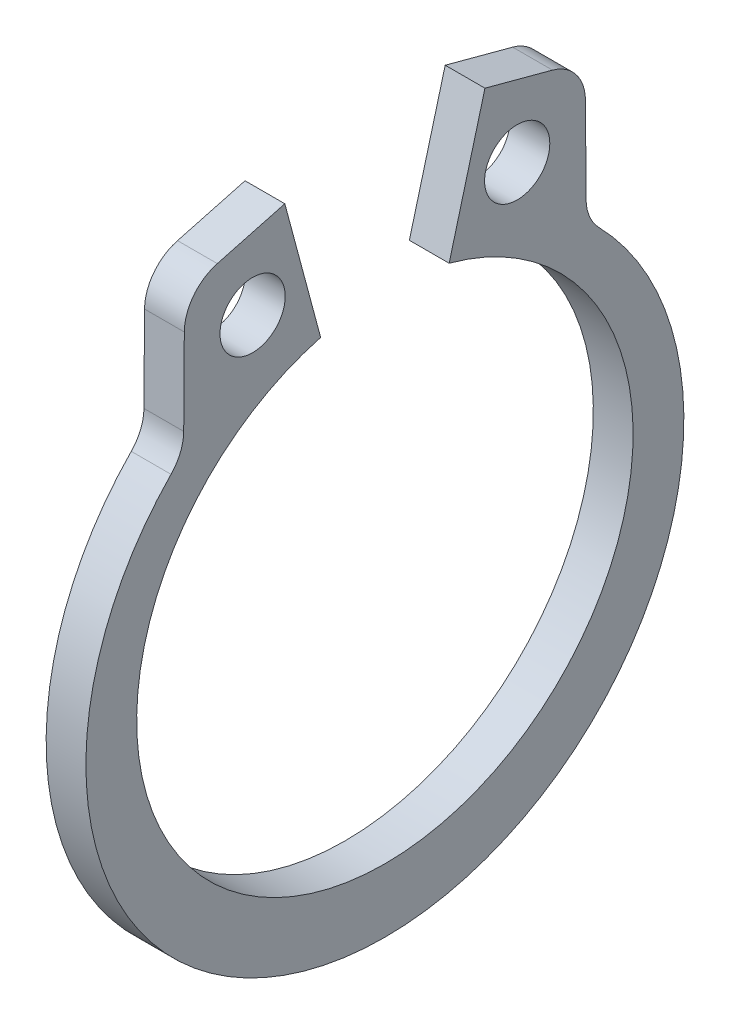
ISO-10303-21;
HEADER;
FILE_DESCRIPTION(('STEP AP214'),'2;1');
FILE_NAME('part.step','',(''),(''),'','','');
FILE_SCHEMA(('AUTOMOTIVE_DESIGN { 1 0 10303 214 1 1 1 1 }'));
ENDSEC;
DATA;
#1=APPLICATION_CONTEXT('core data for automotive mechanical design processes');
#2=APPLICATION_PROTOCOL_DEFINITION('international standard','automotive_design',2000,#1);
#3=PRODUCT_CONTEXT('',#1,'mechanical');
#4=PRODUCT('Part','Part','',(#3));
#5=PRODUCT_RELATED_PRODUCT_CATEGORY('part','',(#4));
#6=PRODUCT_DEFINITION_FORMATION('','',#4);
#7=PRODUCT_DEFINITION_CONTEXT('part definition',#1,'design');
#8=PRODUCT_DEFINITION('design','',#6,#7);
#9=PRODUCT_DEFINITION_SHAPE('','',#8);
#10=(LENGTH_UNIT() NAMED_UNIT(*) SI_UNIT(.MILLI.,.METRE.));
#11=(NAMED_UNIT(*) PLANE_ANGLE_UNIT() SI_UNIT($,.RADIAN.));
#12=(NAMED_UNIT(*) SI_UNIT($,.STERADIAN.) SOLID_ANGLE_UNIT());
#13=UNCERTAINTY_MEASURE_WITH_UNIT(LENGTH_MEASURE(1.E-05),#10,'distance_accuracy_value','');
#14=(GEOMETRIC_REPRESENTATION_CONTEXT(3) GLOBAL_UNCERTAINTY_ASSIGNED_CONTEXT((#13)) GLOBAL_UNIT_ASSIGNED_CONTEXT((#10,
#11,#12)) REPRESENTATION_CONTEXT('',''));
#15=CARTESIAN_POINT('',(0.,0.,0.));
#16=DIRECTION('',(0.,0.,1.));
#17=DIRECTION('',(1.,0.,0.));
#18=AXIS2_PLACEMENT_3D('',#15,#16,#17);
#19=CARTESIAN_POINT('',(0.3175,0.,0.));
#20=DIRECTION('',(1.,0.,0.));
#21=DIRECTION('',(0.,0.,-1.));
#22=AXIS2_PLACEMENT_3D('',#19,#20,#21);
#23=PLANE('',#22);
#24=CARTESIAN_POINT('',(0.3175,4.68015906735426,2.1119523313481));
#25=DIRECTION('',(1.,0.,0.));
#26=DIRECTION('',(0.,0.,-1.));
#27=AXIS2_PLACEMENT_3D('',#24,#25,#26);
#28=CIRCLE('',#27,0.5207);
#29=CARTESIAN_POINT('',(0.3175,4.68015906735426,1.5912523313481));
#30=VERTEX_POINT('',#29);
#31=EDGE_CURVE('E222',#30,#30,#28,.T.);
#32=ORIENTED_EDGE('',*,*,#31,.F.);
#33=EDGE_LOOP('',(#32));
#34=FACE_BOUND('',#33,.T.);
#35=DIRECTION('',(0.,-0.258819045102521,0.965925826289068));
#36=VECTOR('',#35,1.);
#37=CARTESIAN_POINT('',(0.3175,5.96188738502139,1.59748291018178));
#38=LINE('',#37,#36);
#39=CARTESIAN_POINT('',(0.3175,5.96188738502139,1.59748291018178));
#40=VERTEX_POINT('',#39);
#41=CARTESIAN_POINT('',(0.3175,5.67317653625102,2.67496646648911));
#42=VERTEX_POINT('',#41);
#43=EDGE_CURVE('E134',#40,#42,#38,.T.);
#44=ORIENTED_EDGE('',*,*,#43,.T.);
#45=CARTESIAN_POINT('',(0.3175,4.98621008859424,2.4908943616122));
#46=DIRECTION('',(1.,0.,0.));
#47=DIRECTION('',(0.,0.,-1.));
#48=AXIS2_PLACEMENT_3D('',#45,#46,#47);
#49=CIRCLE('',#48,0.7112);
#50=CARTESIAN_POINT('',(0.3175,4.99108945397262,3.20207762336229));
#51=VERTEX_POINT('',#50);
#52=EDGE_CURVE('E175',#42,#51,#49,.T.);
#53=ORIENTED_EDGE('',*,*,#52,.T.);
#54=DIRECTION('',(0.,-0.999976464777974,0.00686074996960175));
#55=VECTOR('',#54,1.);
#56=CARTESIAN_POINT('',(0.3175,5.53293364062072,3.19836007838197));
#57=LINE('',#56,#55);
#58=CARTESIAN_POINT('',(0.3175,3.62180263716441,3.21147217895204));
#59=VERTEX_POINT('',#58);
#60=EDGE_CURVE('E214',#51,#59,#57,.T.);
#61=ORIENTED_EDGE('',*,*,#60,.T.);
#62=CARTESIAN_POINT('',(0.3175,3.62668200254279,3.92265544070213));
#63=DIRECTION('',(1.,0.,0.));
#64=DIRECTION('',(0.,0.,-1.));
#65=AXIS2_PLACEMENT_3D('',#62,#63,#64);
#66=CIRCLE('',#65,0.7112);
#67=CARTESIAN_POINT('',(0.3175,3.12967967197102,3.41393732287436));
#68=VERTEX_POINT('',#67);
#69=EDGE_CURVE('E182',#59,#68,#66,.F.);
#70=ORIENTED_EDGE('',*,*,#69,.T.);
#71=CARTESIAN_POINT('',(0.3175,-0.205634613943439,0.));
#72=DIRECTION('',(1.,0.,0.));
#73=DIRECTION('',(0.,0.,-1.));
#74=AXIS2_PLACEMENT_3D('',#71,#72,#73);
#75=CIRCLE('',#74,4.77276538605656);
#76=CARTESIAN_POINT('',(0.3175,3.12967967197102,-3.41393732287436));
#77=VERTEX_POINT('',#76);
#78=EDGE_CURVE('E207',#68,#77,#75,.T.);
#79=ORIENTED_EDGE('',*,*,#78,.T.);
#80=CARTESIAN_POINT('',(0.3175,3.62668200254279,-3.92265544070213));
#81=DIRECTION('',(1.,0.,0.));
#82=DIRECTION('',(0.,0.,-1.));
#83=AXIS2_PLACEMENT_3D('',#80,#81,#82);
#84=CIRCLE('',#83,0.7112);
#85=CARTESIAN_POINT('',(0.3175,3.62180263716441,-3.21147217895204));
#86=VERTEX_POINT('',#85);
#87=EDGE_CURVE('E11',#77,#86,#84,.F.);
#88=ORIENTED_EDGE('',*,*,#87,.T.);
#89=DIRECTION('',(0.,0.999976464777974,0.00686074996960175));
#90=VECTOR('',#89,1.);
#91=CARTESIAN_POINT('',(0.3175,5.53293364062072,-3.19836007838197));
#92=LINE('',#91,#90);
#93=CARTESIAN_POINT('',(0.3175,4.99108945397262,-3.20207762336229));
#94=VERTEX_POINT('',#93);
#95=EDGE_CURVE('E206',#86,#94,#92,.T.);
#96=ORIENTED_EDGE('',*,*,#95,.T.);
#97=CARTESIAN_POINT('',(0.3175,4.98621008859424,-2.4908943616122));
#98=DIRECTION('',(1.,0.,0.));
#99=DIRECTION('',(0.,0.,-1.));
#100=AXIS2_PLACEMENT_3D('',#97,#98,#99);
#101=CIRCLE('',#100,0.7112);
#102=CARTESIAN_POINT('',(0.3175,5.67317653625102,-2.67496646648911));
#103=VERTEX_POINT('',#102);
#104=EDGE_CURVE('E50',#94,#103,#101,.T.);
#105=ORIENTED_EDGE('',*,*,#104,.T.);
#106=DIRECTION('',(0.,0.258819045102521,0.965925826289068));
#107=VECTOR('',#106,1.);
#108=CARTESIAN_POINT('',(0.3175,5.96188738502139,-1.59748291018178));
#109=LINE('',#108,#107);
#110=CARTESIAN_POINT('',(0.3175,5.96188738502139,-1.59748291018178));
#111=VERTEX_POINT('',#110);
#112=EDGE_CURVE('E211',#103,#111,#109,.T.);
#113=ORIENTED_EDGE('',*,*,#112,.T.);
#114=DIRECTION('',(0.,-0.965925826289068,0.258819045102521));
#115=VECTOR('',#114,1.);
#116=CARTESIAN_POINT('',(0.3175,3.8273844940878,-1.02554458431423));
#117=LINE('',#116,#115);
#118=CARTESIAN_POINT('',(0.3175,3.8273844940878,-1.02554458431423));
#119=VERTEX_POINT('',#118);
#120=EDGE_CURVE('E140',#111,#119,#117,.T.);
#121=ORIENTED_EDGE('',*,*,#120,.T.);
#122=CARTESIAN_POINT('',(0.3175,0.,0.));
#123=DIRECTION('',(-1.,0.,0.));
#124=DIRECTION('',(0.,0.,-1.));
#125=AXIS2_PLACEMENT_3D('',#122,#123,#124);
#126=CIRCLE('',#125,3.9624);
#127=CARTESIAN_POINT('',(0.3175,3.8273844940878,1.02554458431423));
#128=VERTEX_POINT('',#127);
#129=EDGE_CURVE('E135',#119,#128,#126,.T.);
#130=ORIENTED_EDGE('',*,*,#129,.T.);
#131=DIRECTION('',(0.,0.965925826289068,0.258819045102521));
#132=VECTOR('',#131,1.);
#133=CARTESIAN_POINT('',(0.3175,3.8273844940878,1.02554458431423));
#134=LINE('',#133,#132);
#135=EDGE_CURVE('E126',#128,#40,#134,.T.);
#136=ORIENTED_EDGE('',*,*,#135,.T.);
#137=EDGE_LOOP('',(#44,#53,#61,#70,#79,#88,#96,#105,#113,#121,#130,#136));
#138=FACE_BOUND('',#137,.T.);
#139=CARTESIAN_POINT('',(0.3175,4.68015906735426,-2.1119523313481));
#140=DIRECTION('',(1.,0.,0.));
#141=DIRECTION('',(0.,0.,-1.));
#142=AXIS2_PLACEMENT_3D('',#139,#140,#141);
#143=CIRCLE('',#142,0.5207);
#144=CARTESIAN_POINT('',(0.3175,4.68015906735426,-2.6326523313481));
#145=VERTEX_POINT('',#144);
#146=EDGE_CURVE('E248',#145,#145,#143,.T.);
#147=ORIENTED_EDGE('',*,*,#146,.F.);
#148=EDGE_LOOP('',(#147));
#149=FACE_BOUND('',#148,.T.);
#150=ADVANCED_FACE('F35',(#34,#138,#149),#23,.T.);
#151=CARTESIAN_POINT('',(-0.3175,0.,0.));
#152=DIRECTION('',(1.,0.,0.));
#153=DIRECTION('',(0.,0.,-1.));
#154=AXIS2_PLACEMENT_3D('',#151,#152,#153);
#155=PLANE('',#154);
#156=CARTESIAN_POINT('',(-0.3175,4.68015906735426,2.1119523313481));
#157=DIRECTION('',(1.,0.,0.));
#158=DIRECTION('',(0.,0.,-1.));
#159=AXIS2_PLACEMENT_3D('',#156,#157,#158);
#160=CIRCLE('',#159,0.5207);
#161=CARTESIAN_POINT('',(-0.3175,4.68015906735426,1.5912523313481));
#162=VERTEX_POINT('',#161);
#163=EDGE_CURVE('E245',#162,#162,#160,.T.);
#164=ORIENTED_EDGE('',*,*,#163,.T.);
#165=EDGE_LOOP('',(#164));
#166=FACE_BOUND('',#165,.T.);
#167=DIRECTION('',(0.,-0.999976464777974,0.00686074996960175));
#168=VECTOR('',#167,1.);
#169=CARTESIAN_POINT('',(-0.3175,5.53293364062072,3.19836007838197));
#170=LINE('',#169,#168);
#171=CARTESIAN_POINT('',(-0.3175,4.99108945397262,3.20207762336229));
#172=VERTEX_POINT('',#171);
#173=CARTESIAN_POINT('',(-0.3175,3.62180263716441,3.21147217895204));
#174=VERTEX_POINT('',#173);
#175=EDGE_CURVE('E201',#172,#174,#170,.T.);
#176=ORIENTED_EDGE('',*,*,#175,.F.);
#177=CARTESIAN_POINT('',(-0.3175,4.98621008859424,2.4908943616122));
#178=DIRECTION('',(1.,0.,0.));
#179=DIRECTION('',(0.,0.,-1.));
#180=AXIS2_PLACEMENT_3D('',#177,#178,#179);
#181=CIRCLE('',#180,0.7112);
#182=CARTESIAN_POINT('',(-0.3175,5.67317653625102,2.67496646648911));
#183=VERTEX_POINT('',#182);
#184=EDGE_CURVE('E171',#172,#183,#181,.F.);
#185=ORIENTED_EDGE('',*,*,#184,.T.);
#186=DIRECTION('',(0.,-0.258819045102521,0.965925826289068));
#187=VECTOR('',#186,1.);
#188=CARTESIAN_POINT('',(-0.3175,5.96188738502139,1.59748291018178));
#189=LINE('',#188,#187);
#190=CARTESIAN_POINT('',(-0.3175,5.96188738502139,1.59748291018178));
#191=VERTEX_POINT('',#190);
#192=EDGE_CURVE('E224',#191,#183,#189,.T.);
#193=ORIENTED_EDGE('',*,*,#192,.F.);
#194=DIRECTION('',(0.,0.965925826289068,0.258819045102521));
#195=VECTOR('',#194,1.);
#196=CARTESIAN_POINT('',(-0.3175,3.8273844940878,1.02554458431423));
#197=LINE('',#196,#195);
#198=CARTESIAN_POINT('',(-0.3175,3.8273844940878,1.02554458431423));
#199=VERTEX_POINT('',#198);
#200=EDGE_CURVE('E221',#199,#191,#197,.T.);
#201=ORIENTED_EDGE('',*,*,#200,.F.);
#202=CARTESIAN_POINT('',(-0.3175,0.,0.));
#203=DIRECTION('',(-1.,0.,0.));
#204=DIRECTION('',(0.,0.,-1.));
#205=AXIS2_PLACEMENT_3D('',#202,#203,#204);
#206=CIRCLE('',#205,3.9624);
#207=CARTESIAN_POINT('',(-0.3175,3.8273844940878,-1.02554458431423));
#208=VERTEX_POINT('',#207);
#209=EDGE_CURVE('E148',#208,#199,#206,.T.);
#210=ORIENTED_EDGE('',*,*,#209,.F.);
#211=DIRECTION('',(0.,-0.965925826289068,0.258819045102521));
#212=VECTOR('',#211,1.);
#213=CARTESIAN_POINT('',(-0.3175,3.8273844940878,-1.02554458431423));
#214=LINE('',#213,#212);
#215=CARTESIAN_POINT('',(-0.3175,5.96188738502139,-1.59748291018178));
#216=VERTEX_POINT('',#215);
#217=EDGE_CURVE('E144',#216,#208,#214,.T.);
#218=ORIENTED_EDGE('',*,*,#217,.F.);
#219=DIRECTION('',(0.,0.258819045102521,0.965925826289068));
#220=VECTOR('',#219,1.);
#221=CARTESIAN_POINT('',(-0.3175,5.96188738502139,-1.59748291018178));
#222=LINE('',#221,#220);
#223=CARTESIAN_POINT('',(-0.3175,5.67317653625102,-2.67496646648911));
#224=VERTEX_POINT('',#223);
#225=EDGE_CURVE('E229',#224,#216,#222,.T.);
#226=ORIENTED_EDGE('',*,*,#225,.F.);
#227=CARTESIAN_POINT('',(-0.3175,4.98621008859424,-2.4908943616122));
#228=DIRECTION('',(1.,0.,0.));
#229=DIRECTION('',(0.,0.,-1.));
#230=AXIS2_PLACEMENT_3D('',#227,#228,#229);
#231=CIRCLE('',#230,0.7112);
#232=CARTESIAN_POINT('',(-0.3175,4.99108945397262,-3.20207762336229));
#233=VERTEX_POINT('',#232);
#234=EDGE_CURVE('E169',#224,#233,#231,.F.);
#235=ORIENTED_EDGE('',*,*,#234,.T.);
#236=DIRECTION('',(0.,0.999976464777974,0.00686074996960175));
#237=VECTOR('',#236,1.);
#238=CARTESIAN_POINT('',(-0.3175,5.53293364062072,-3.19836007838197));
#239=LINE('',#238,#237);
#240=CARTESIAN_POINT('',(-0.3175,3.62180263716441,-3.21147217895204));
#241=VERTEX_POINT('',#240);
#242=EDGE_CURVE('E192',#241,#233,#239,.T.);
#243=ORIENTED_EDGE('',*,*,#242,.F.);
#244=CARTESIAN_POINT('',(-0.3175,3.62668200254279,-3.92265544070213));
#245=DIRECTION('',(1.,0.,0.));
#246=DIRECTION('',(0.,0.,-1.));
#247=AXIS2_PLACEMENT_3D('',#244,#245,#246);
#248=CIRCLE('',#247,0.7112);
#249=CARTESIAN_POINT('',(-0.3175,3.12967967197102,-3.41393732287436));
#250=VERTEX_POINT('',#249);
#251=EDGE_CURVE('E43',#241,#250,#248,.T.);
#252=ORIENTED_EDGE('',*,*,#251,.T.);
#253=CARTESIAN_POINT('',(-0.3175,-0.205634613943439,0.));
#254=DIRECTION('',(1.,0.,0.));
#255=DIRECTION('',(0.,0.,-1.));
#256=AXIS2_PLACEMENT_3D('',#253,#254,#255);
#257=CIRCLE('',#256,4.77276538605656);
#258=CARTESIAN_POINT('',(-0.3175,3.12967967197102,3.41393732287436));
#259=VERTEX_POINT('',#258);
#260=EDGE_CURVE('E190',#259,#250,#257,.T.);
#261=ORIENTED_EDGE('',*,*,#260,.F.);
#262=CARTESIAN_POINT('',(-0.3175,3.62668200254279,3.92265544070213));
#263=DIRECTION('',(1.,0.,0.));
#264=DIRECTION('',(0.,0.,-1.));
#265=AXIS2_PLACEMENT_3D('',#262,#263,#264);
#266=CIRCLE('',#265,0.7112);
#267=EDGE_CURVE('E180',#259,#174,#266,.T.);
#268=ORIENTED_EDGE('',*,*,#267,.T.);
#269=EDGE_LOOP('',(#176,#185,#193,#201,#210,#218,#226,#235,#243,#252,#261,#268));
#270=FACE_BOUND('',#269,.T.);
#271=CARTESIAN_POINT('',(-0.3175,4.68015906735426,-2.1119523313481));
#272=DIRECTION('',(1.,0.,0.));
#273=DIRECTION('',(0.,0.,-1.));
#274=AXIS2_PLACEMENT_3D('',#271,#272,#273);
#275=CIRCLE('',#274,0.5207);
#276=CARTESIAN_POINT('',(-0.3175,4.68015906735426,-2.6326523313481));
#277=VERTEX_POINT('',#276);
#278=EDGE_CURVE('E251',#277,#277,#275,.T.);
#279=ORIENTED_EDGE('',*,*,#278,.T.);
#280=EDGE_LOOP('',(#279));
#281=FACE_BOUND('',#280,.T.);
#282=ADVANCED_FACE('F188',(#166,#270,#281),#155,.F.);
#283=CARTESIAN_POINT('',(0.3175,0.,0.));
#284=DIRECTION('',(-1.,0.,0.));
#285=DIRECTION('',(0.,0.,1.));
#286=AXIS2_PLACEMENT_3D('',#283,#284,#285);
#287=CYLINDRICAL_SURFACE('',#286,3.9624);
#288=ORIENTED_EDGE('',*,*,#209,.T.);
#289=DIRECTION('',(-1.,0.,0.));
#290=VECTOR('',#289,1.);
#291=CARTESIAN_POINT('',(0.3175,3.8273844940878,1.02554458431423));
#292=LINE('',#291,#290);
#293=EDGE_CURVE('E130',#128,#199,#292,.T.);
#294=ORIENTED_EDGE('',*,*,#293,.F.);
#295=ORIENTED_EDGE('',*,*,#129,.F.);
#296=DIRECTION('',(-1.,0.,0.));
#297=VECTOR('',#296,1.);
#298=CARTESIAN_POINT('',(0.3175,3.8273844940878,-1.02554458431423));
#299=LINE('',#298,#297);
#300=EDGE_CURVE('E219',#119,#208,#299,.T.);
#301=ORIENTED_EDGE('',*,*,#300,.T.);
#302=EDGE_LOOP('',(#288,#294,#295,#301));
#303=FACE_BOUND('',#302,.T.);
#304=ADVANCED_FACE('F146',(#303),#287,.F.);
#305=CARTESIAN_POINT('',(0.3175,3.8273844940878,1.02554458431423));
#306=DIRECTION('',(0.,-0.258819045102521,0.965925826289068));
#307=DIRECTION('',(0.,-0.965925826289068,-0.258819045102521));
#308=AXIS2_PLACEMENT_3D('',#305,#306,#307);
#309=PLANE('',#308);
#310=ORIENTED_EDGE('',*,*,#200,.T.);
#311=DIRECTION('',(-1.,0.,0.));
#312=VECTOR('',#311,1.);
#313=CARTESIAN_POINT('',(0.3175,5.96188738502139,1.59748291018178));
#314=LINE('',#313,#312);
#315=EDGE_CURVE('E133',#40,#191,#314,.T.);
#316=ORIENTED_EDGE('',*,*,#315,.F.);
#317=ORIENTED_EDGE('',*,*,#135,.F.);
#318=ORIENTED_EDGE('',*,*,#293,.T.);
#319=EDGE_LOOP('',(#310,#316,#317,#318));
#320=FACE_BOUND('',#319,.T.);
#321=ADVANCED_FACE('F128',(#320),#309,.F.);
#322=CARTESIAN_POINT('',(0.3175,5.96188738502139,1.59748291018178));
#323=DIRECTION('',(0.,-0.965925826289068,-0.258819045102521));
#324=DIRECTION('',(0.,0.258819045102521,-0.965925826289068));
#325=AXIS2_PLACEMENT_3D('',#322,#323,#324);
#326=PLANE('',#325);
#327=ORIENTED_EDGE('',*,*,#192,.T.);
#328=DIRECTION('',(-1.,0.,0.));
#329=VECTOR('',#328,1.);
#330=CARTESIAN_POINT('',(0.3175,5.67317653625102,2.67496646648911));
#331=LINE('',#330,#329);
#332=EDGE_CURVE('E58',#183,#42,#331,.F.);
#333=ORIENTED_EDGE('',*,*,#332,.T.);
#334=ORIENTED_EDGE('',*,*,#43,.F.);
#335=ORIENTED_EDGE('',*,*,#315,.T.);
#336=EDGE_LOOP('',(#327,#333,#334,#335));
#337=FACE_BOUND('',#336,.T.);
#338=ADVANCED_FACE('F240',(#337),#326,.F.);
#339=CARTESIAN_POINT('',(0.3175,5.53293364062072,3.19836007838197));
#340=DIRECTION('',(0.,-0.00686074996960175,-0.999976464777974));
#341=DIRECTION('',(0.,0.999976464777974,-0.00686074996960175));
#342=AXIS2_PLACEMENT_3D('',#339,#340,#341);
#343=PLANE('',#342);
#344=ORIENTED_EDGE('',*,*,#175,.T.);
#345=DIRECTION('',(1.,0.,0.));
#346=VECTOR('',#345,1.);
#347=CARTESIAN_POINT('',(0.3175,3.62180263716441,3.21147217895204));
#348=LINE('',#347,#346);
#349=EDGE_CURVE('E162',#174,#59,#348,.T.);
#350=ORIENTED_EDGE('',*,*,#349,.T.);
#351=ORIENTED_EDGE('',*,*,#60,.F.);
#352=DIRECTION('',(-1.,0.,0.));
#353=VECTOR('',#352,1.);
#354=CARTESIAN_POINT('',(0.3175,4.99108945397262,3.20207762336229));
#355=LINE('',#354,#353);
#356=EDGE_CURVE('E159',#51,#172,#355,.T.);
#357=ORIENTED_EDGE('',*,*,#356,.T.);
#358=EDGE_LOOP('',(#344,#350,#351,#357));
#359=FACE_BOUND('',#358,.T.);
#360=ADVANCED_FACE('F281',(#359),#343,.F.);
#361=CARTESIAN_POINT('',(0.3175,-0.205634613943439,0.));
#362=DIRECTION('',(-1.,0.,0.));
#363=DIRECTION('',(0.,0.,1.));
#364=AXIS2_PLACEMENT_3D('',#361,#362,#363);
#365=CYLINDRICAL_SURFACE('',#364,4.77276538605656);
#366=ORIENTED_EDGE('',*,*,#78,.F.);
#367=DIRECTION('',(-1.,0.,0.));
#368=VECTOR('',#367,1.);
#369=CARTESIAN_POINT('',(0.3175,3.12967967197102,3.41393732287436));
#370=LINE('',#369,#368);
#371=EDGE_CURVE('E151',#68,#259,#370,.T.);
#372=ORIENTED_EDGE('',*,*,#371,.T.);
#373=ORIENTED_EDGE('',*,*,#260,.T.);
#374=DIRECTION('',(-1.,0.,0.));
#375=VECTOR('',#374,1.);
#376=CARTESIAN_POINT('',(0.3175,3.12967967197102,-3.41393732287436));
#377=LINE('',#376,#375);
#378=EDGE_CURVE('E149',#250,#77,#377,.F.);
#379=ORIENTED_EDGE('',*,*,#378,.T.);
#380=EDGE_LOOP('',(#366,#372,#373,#379));
#381=FACE_BOUND('',#380,.T.);
#382=ADVANCED_FACE('F198',(#381),#365,.T.);
#383=CARTESIAN_POINT('',(0.3175,5.53293364062072,-3.19836007838197));
#384=DIRECTION('',(0.,-0.00686074996960175,0.999976464777974));
#385=DIRECTION('',(0.,-0.999976464777974,-0.00686074996960175));
#386=AXIS2_PLACEMENT_3D('',#383,#384,#385);
#387=PLANE('',#386);
#388=ORIENTED_EDGE('',*,*,#95,.F.);
#389=DIRECTION('',(1.,0.,0.));
#390=VECTOR('',#389,1.);
#391=CARTESIAN_POINT('',(-0.3175,3.62180263716441,-3.21147217895204));
#392=LINE('',#391,#390);
#393=EDGE_CURVE('E166',#86,#241,#392,.F.);
#394=ORIENTED_EDGE('',*,*,#393,.T.);
#395=ORIENTED_EDGE('',*,*,#242,.T.);
#396=DIRECTION('',(-1.,0.,0.));
#397=VECTOR('',#396,1.);
#398=CARTESIAN_POINT('',(0.3175,4.99108945397262,-3.20207762336229));
#399=LINE('',#398,#397);
#400=EDGE_CURVE('E164',#233,#94,#399,.F.);
#401=ORIENTED_EDGE('',*,*,#400,.T.);
#402=EDGE_LOOP('',(#388,#394,#395,#401));
#403=FACE_BOUND('',#402,.T.);
#404=ADVANCED_FACE('F209',(#403),#387,.F.);
#405=CARTESIAN_POINT('',(0.3175,5.96188738502139,-1.59748291018178));
#406=DIRECTION('',(0.,-0.965925826289068,0.258819045102521));
#407=DIRECTION('',(0.,-0.258819045102521,-0.965925826289068));
#408=AXIS2_PLACEMENT_3D('',#405,#406,#407);
#409=PLANE('',#408);
#410=ORIENTED_EDGE('',*,*,#112,.F.);
#411=DIRECTION('',(-1.,0.,0.));
#412=VECTOR('',#411,1.);
#413=CARTESIAN_POINT('',(0.3175,5.67317653625102,-2.67496646648911));
#414=LINE('',#413,#412);
#415=EDGE_CURVE('E177',#103,#224,#414,.T.);
#416=ORIENTED_EDGE('',*,*,#415,.T.);
#417=ORIENTED_EDGE('',*,*,#225,.T.);
#418=DIRECTION('',(-1.,0.,0.));
#419=VECTOR('',#418,1.);
#420=CARTESIAN_POINT('',(0.3175,5.96188738502139,-1.59748291018178));
#421=LINE('',#420,#419);
#422=EDGE_CURVE('E153',#111,#216,#421,.T.);
#423=ORIENTED_EDGE('',*,*,#422,.F.);
#424=EDGE_LOOP('',(#410,#416,#417,#423));
#425=FACE_BOUND('',#424,.T.);
#426=ADVANCED_FACE('F274',(#425),#409,.F.);
#427=CARTESIAN_POINT('',(0.3175,3.8273844940878,-1.02554458431423));
#428=DIRECTION('',(0.,-0.258819045102521,-0.965925826289068));
#429=DIRECTION('',(0.,0.965925826289068,-0.258819045102521));
#430=AXIS2_PLACEMENT_3D('',#427,#428,#429);
#431=PLANE('',#430);
#432=ORIENTED_EDGE('',*,*,#217,.T.);
#433=ORIENTED_EDGE('',*,*,#300,.F.);
#434=ORIENTED_EDGE('',*,*,#120,.F.);
#435=ORIENTED_EDGE('',*,*,#422,.T.);
#436=EDGE_LOOP('',(#432,#433,#434,#435));
#437=FACE_BOUND('',#436,.T.);
#438=ADVANCED_FACE('F236',(#437),#431,.F.);
#439=CARTESIAN_POINT('',(0.3175,4.68015906735426,2.1119523313481));
#440=DIRECTION('',(-1.,0.,0.));
#441=DIRECTION('',(0.,0.,1.));
#442=AXIS2_PLACEMENT_3D('',#439,#440,#441);
#443=CYLINDRICAL_SURFACE('',#442,0.5207);
#444=ORIENTED_EDGE('',*,*,#31,.T.);
#445=EDGE_LOOP('',(#444));
#446=FACE_BOUND('',#445,.T.);
#447=ORIENTED_EDGE('',*,*,#163,.F.);
#448=EDGE_LOOP('',(#447));
#449=FACE_BOUND('',#448,.T.);
#450=ADVANCED_FACE('F269',(#446,#449),#443,.F.);
#451=CARTESIAN_POINT('',(0.3175,4.68015906735426,-2.1119523313481));
#452=DIRECTION('',(-1.,0.,0.));
#453=DIRECTION('',(0.,0.,1.));
#454=AXIS2_PLACEMENT_3D('',#451,#452,#453);
#455=CYLINDRICAL_SURFACE('',#454,0.5207);
#456=ORIENTED_EDGE('',*,*,#146,.T.);
#457=EDGE_LOOP('',(#456));
#458=FACE_BOUND('',#457,.T.);
#459=ORIENTED_EDGE('',*,*,#278,.F.);
#460=EDGE_LOOP('',(#459));
#461=FACE_BOUND('',#460,.T.);
#462=ADVANCED_FACE('F257',(#458,#461),#455,.F.);
#463=CARTESIAN_POINT('',(0.3175,3.62668200254279,3.92265544070213));
#464=DIRECTION('',(-1.,0.,0.));
#465=DIRECTION('',(0.,0.,1.));
#466=AXIS2_PLACEMENT_3D('',#463,#464,#465);
#467=CYLINDRICAL_SURFACE('',#466,0.7112);
#468=ORIENTED_EDGE('',*,*,#69,.F.);
#469=ORIENTED_EDGE('',*,*,#349,.F.);
#470=ORIENTED_EDGE('',*,*,#267,.F.);
#471=ORIENTED_EDGE('',*,*,#371,.F.);
#472=EDGE_LOOP('',(#468,#469,#470,#471));
#473=FACE_BOUND('',#472,.T.);
#474=ADVANCED_FACE('F291',(#473),#467,.F.);
#475=CARTESIAN_POINT('',(0.3175,3.62668200254279,-3.92265544070213));
#476=DIRECTION('',(-1.,0.,0.));
#477=DIRECTION('',(0.,0.,1.));
#478=AXIS2_PLACEMENT_3D('',#475,#476,#477);
#479=CYLINDRICAL_SURFACE('',#478,0.7112);
#480=ORIENTED_EDGE('',*,*,#87,.F.);
#481=ORIENTED_EDGE('',*,*,#378,.F.);
#482=ORIENTED_EDGE('',*,*,#251,.F.);
#483=ORIENTED_EDGE('',*,*,#393,.F.);
#484=EDGE_LOOP('',(#480,#481,#482,#483));
#485=FACE_BOUND('',#484,.T.);
#486=ADVANCED_FACE('F204',(#485),#479,.F.);
#487=CARTESIAN_POINT('',(0.3175,4.98621008859424,2.4908943616122));
#488=DIRECTION('',(-1.,0.,0.));
#489=DIRECTION('',(0.,0.,1.));
#490=AXIS2_PLACEMENT_3D('',#487,#488,#489);
#491=CYLINDRICAL_SURFACE('',#490,0.7112);
#492=ORIENTED_EDGE('',*,*,#52,.F.);
#493=ORIENTED_EDGE('',*,*,#332,.F.);
#494=ORIENTED_EDGE('',*,*,#184,.F.);
#495=ORIENTED_EDGE('',*,*,#356,.F.);
#496=EDGE_LOOP('',(#492,#493,#494,#495));
#497=FACE_BOUND('',#496,.T.);
#498=ADVANCED_FACE('F296',(#497),#491,.T.);
#499=CARTESIAN_POINT('',(0.3175,4.98621008859424,-2.4908943616122));
#500=DIRECTION('',(-1.,0.,0.));
#501=DIRECTION('',(0.,0.,1.));
#502=AXIS2_PLACEMENT_3D('',#499,#500,#501);
#503=CYLINDRICAL_SURFACE('',#502,0.7112);
#504=ORIENTED_EDGE('',*,*,#104,.F.);
#505=ORIENTED_EDGE('',*,*,#400,.F.);
#506=ORIENTED_EDGE('',*,*,#234,.F.);
#507=ORIENTED_EDGE('',*,*,#415,.F.);
#508=EDGE_LOOP('',(#504,#505,#506,#507));
#509=FACE_BOUND('',#508,.T.);
#510=ADVANCED_FACE('F37',(#509),#503,.T.);
#511=CLOSED_SHELL('',(#150,#282,#304,#321,#338,#360,#382,#404,#426,#438,#450,#462,#474,#486,
#498,#510));
#512=MANIFOLD_SOLID_BREP('B2',#511);
#513=ADVANCED_BREP_SHAPE_REPRESENTATION('',(#18,#512),#14);
#514=SHAPE_DEFINITION_REPRESENTATION(#9,#513);
ENDSEC;
END-ISO-10303-21;
